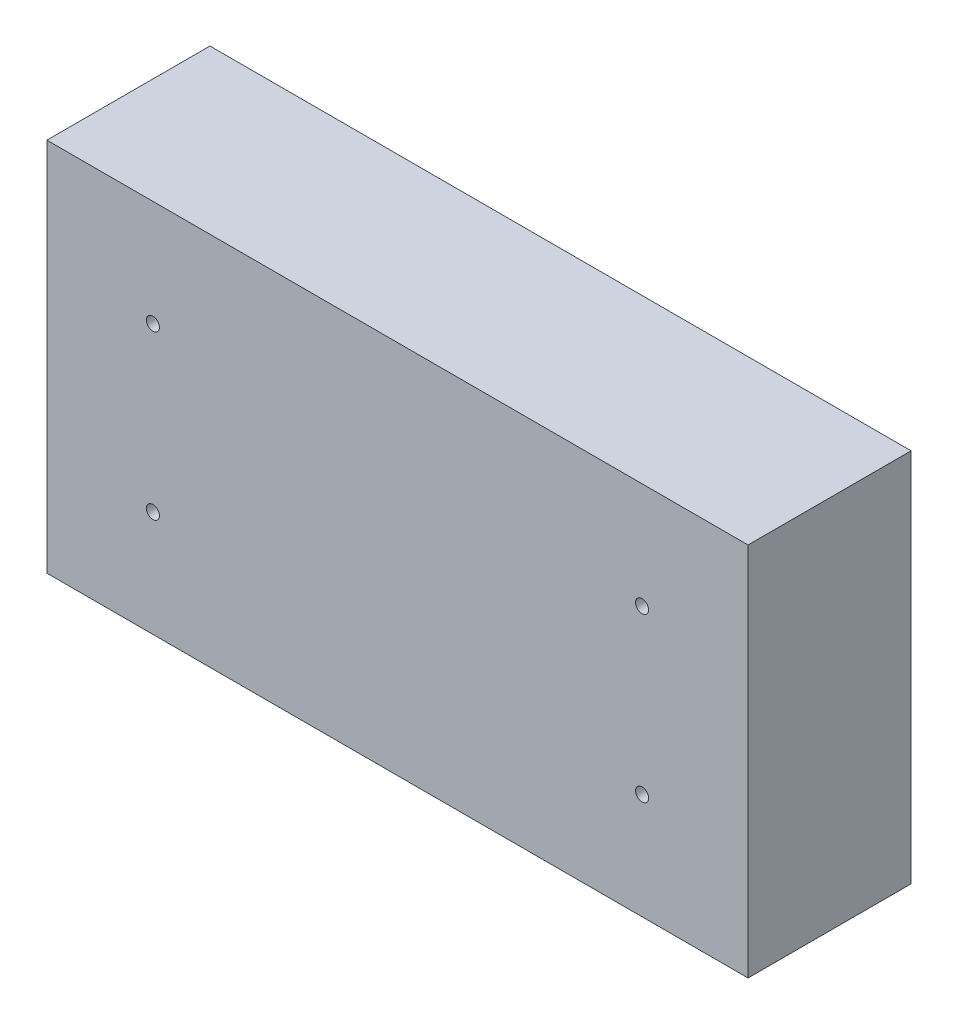
ISO-10303-21;
HEADER;
FILE_DESCRIPTION(('STEP AP214'),'2;1');
FILE_NAME('part.step','',(''),(''),'','','');
FILE_SCHEMA(('AUTOMOTIVE_DESIGN { 1 0 10303 214 1 1 1 1 }'));
ENDSEC;
DATA;
#1=APPLICATION_CONTEXT('core data for automotive mechanical design processes');
#2=APPLICATION_PROTOCOL_DEFINITION('international standard','automotive_design',2000,#1);
#3=PRODUCT_CONTEXT('',#1,'mechanical');
#4=PRODUCT('Part','Part','',(#3));
#5=PRODUCT_RELATED_PRODUCT_CATEGORY('part','',(#4));
#6=PRODUCT_DEFINITION_FORMATION('','',#4);
#7=PRODUCT_DEFINITION_CONTEXT('part definition',#1,'design');
#8=PRODUCT_DEFINITION('design','',#6,#7);
#9=PRODUCT_DEFINITION_SHAPE('','',#8);
#10=(LENGTH_UNIT() NAMED_UNIT(*) SI_UNIT(.MILLI.,.METRE.));
#11=(NAMED_UNIT(*) PLANE_ANGLE_UNIT() SI_UNIT($,.RADIAN.));
#12=(NAMED_UNIT(*) SI_UNIT($,.STERADIAN.) SOLID_ANGLE_UNIT());
#13=UNCERTAINTY_MEASURE_WITH_UNIT(LENGTH_MEASURE(1.E-05),#10,'distance_accuracy_value','');
#14=(GEOMETRIC_REPRESENTATION_CONTEXT(3) GLOBAL_UNCERTAINTY_ASSIGNED_CONTEXT((#13)) GLOBAL_UNIT_ASSIGNED_CONTEXT((#10,
#11,#12)) REPRESENTATION_CONTEXT('',''));
#15=CARTESIAN_POINT('',(0.,0.,0.));
#16=DIRECTION('',(0.,0.,1.));
#17=DIRECTION('',(1.,0.,0.));
#18=AXIS2_PLACEMENT_3D('',#15,#16,#17);
#19=CARTESIAN_POINT('',(182.5,32.5,44.3991393809724));
#20=DIRECTION('',(0.,0.,1.));
#21=DIRECTION('',(1.,0.,0.));
#22=AXIS2_PLACEMENT_3D('',#19,#20,#21);
#23=CONICAL_SURFACE('',#22,1.,1.02974425867665);
#24=CARTESIAN_POINT('',(182.5,32.5,43.7982787619449));
#25=VERTEX_POINT('',#24);
#26=VERTEX_LOOP('',#25);
#27=FACE_BOUND('',#26,.T.);
#28=CARTESIAN_POINT('',(182.5,32.5,45.));
#29=DIRECTION('',(0.,0.,1.));
#30=DIRECTION('',(1.,0.,0.));
#31=AXIS2_PLACEMENT_3D('',#28,#29,#30);
#32=CIRCLE('',#31,2.);
#33=CARTESIAN_POINT('',(184.5,32.5,45.));
#34=VERTEX_POINT('',#33);
#35=EDGE_CURVE('E9',#34,#34,#32,.T.);
#36=ORIENTED_EDGE('',*,*,#35,.T.);
#37=EDGE_LOOP('',(#36));
#38=FACE_BOUND('',#37,.T.);
#39=ADVANCED_FACE('F15',(#27,#38),#23,.F.);
#40=CARTESIAN_POINT('',(182.5,32.5,47.5));
#41=DIRECTION('',(0.,0.,1.));
#42=DIRECTION('',(1.,0.,0.));
#43=AXIS2_PLACEMENT_3D('',#40,#41,#42);
#44=CYLINDRICAL_SURFACE('',#43,2.);
#45=CARTESIAN_POINT('',(182.5,32.5,50.));
#46=DIRECTION('',(0.,0.,-1.));
#47=DIRECTION('',(0.,-1.,0.));
#48=AXIS2_PLACEMENT_3D('',#45,#46,#47);
#49=CIRCLE('',#48,2.);
#50=CARTESIAN_POINT('',(182.5,30.5,50.));
#51=VERTEX_POINT('',#50);
#52=EDGE_CURVE('E102',#51,#51,#49,.T.);
#53=ORIENTED_EDGE('',*,*,#52,.F.);
#54=EDGE_LOOP('',(#53));
#55=FACE_BOUND('',#54,.T.);
#56=ORIENTED_EDGE('',*,*,#35,.F.);
#57=EDGE_LOOP('',(#56));
#58=FACE_BOUND('',#57,.T.);
#59=ADVANCED_FACE('F131',(#55,#58),#44,.F.);
#60=CARTESIAN_POINT('',(32.5,82.5,44.3991393809724));
#61=DIRECTION('',(0.,0.,1.));
#62=DIRECTION('',(1.,0.,0.));
#63=AXIS2_PLACEMENT_3D('',#60,#61,#62);
#64=CONICAL_SURFACE('',#63,1.,1.02974425867665);
#65=CARTESIAN_POINT('',(32.5,82.5,43.7982787619449));
#66=VERTEX_POINT('',#65);
#67=VERTEX_LOOP('',#66);
#68=FACE_BOUND('',#67,.T.);
#69=CARTESIAN_POINT('',(32.5,82.5,45.));
#70=DIRECTION('',(0.,0.,1.));
#71=DIRECTION('',(1.,0.,0.));
#72=AXIS2_PLACEMENT_3D('',#69,#70,#71);
#73=CIRCLE('',#72,2.);
#74=CARTESIAN_POINT('',(34.5,82.5,45.));
#75=VERTEX_POINT('',#74);
#76=EDGE_CURVE('E24',#75,#75,#73,.T.);
#77=ORIENTED_EDGE('',*,*,#76,.T.);
#78=EDGE_LOOP('',(#77));
#79=FACE_BOUND('',#78,.T.);
#80=ADVANCED_FACE('F137',(#68,#79),#64,.F.);
#81=CARTESIAN_POINT('',(32.5,82.5,47.5));
#82=DIRECTION('',(0.,0.,1.));
#83=DIRECTION('',(1.,0.,0.));
#84=AXIS2_PLACEMENT_3D('',#81,#82,#83);
#85=CYLINDRICAL_SURFACE('',#84,2.);
#86=CARTESIAN_POINT('',(32.5,82.5,50.));
#87=DIRECTION('',(0.,0.,-1.));
#88=DIRECTION('',(0.,-1.,0.));
#89=AXIS2_PLACEMENT_3D('',#86,#87,#88);
#90=CIRCLE('',#89,2.);
#91=CARTESIAN_POINT('',(32.5,80.5,50.));
#92=VERTEX_POINT('',#91);
#93=EDGE_CURVE('E115',#92,#92,#90,.T.);
#94=ORIENTED_EDGE('',*,*,#93,.F.);
#95=EDGE_LOOP('',(#94));
#96=FACE_BOUND('',#95,.T.);
#97=ORIENTED_EDGE('',*,*,#76,.F.);
#98=EDGE_LOOP('',(#97));
#99=FACE_BOUND('',#98,.T.);
#100=ADVANCED_FACE('F144',(#96,#99),#85,.F.);
#101=CARTESIAN_POINT('',(32.5,32.5,44.3991393809724));
#102=DIRECTION('',(0.,0.,1.));
#103=DIRECTION('',(1.,0.,0.));
#104=AXIS2_PLACEMENT_3D('',#101,#102,#103);
#105=CONICAL_SURFACE('',#104,1.,1.02974425867665);
#106=CARTESIAN_POINT('',(32.5,32.5,43.7982787619449));
#107=VERTEX_POINT('',#106);
#108=VERTEX_LOOP('',#107);
#109=FACE_BOUND('',#108,.T.);
#110=CARTESIAN_POINT('',(32.5,32.5,45.));
#111=DIRECTION('',(0.,0.,1.));
#112=DIRECTION('',(1.,0.,0.));
#113=AXIS2_PLACEMENT_3D('',#110,#111,#112);
#114=CIRCLE('',#113,2.);
#115=CARTESIAN_POINT('',(34.5,32.5,45.));
#116=VERTEX_POINT('',#115);
#117=EDGE_CURVE('E218',#116,#116,#114,.T.);
#118=ORIENTED_EDGE('',*,*,#117,.T.);
#119=EDGE_LOOP('',(#118));
#120=FACE_BOUND('',#119,.T.);
#121=ADVANCED_FACE('F148',(#109,#120),#105,.F.);
#122=CARTESIAN_POINT('',(32.5,32.5,47.5));
#123=DIRECTION('',(0.,0.,1.));
#124=DIRECTION('',(1.,0.,0.));
#125=AXIS2_PLACEMENT_3D('',#122,#123,#124);
#126=CYLINDRICAL_SURFACE('',#125,2.);
#127=CARTESIAN_POINT('',(32.5,32.5,50.));
#128=DIRECTION('',(0.,0.,-1.));
#129=DIRECTION('',(0.,-1.,0.));
#130=AXIS2_PLACEMENT_3D('',#127,#128,#129);
#131=CIRCLE('',#130,2.);
#132=CARTESIAN_POINT('',(32.5,30.5,50.));
#133=VERTEX_POINT('',#132);
#134=EDGE_CURVE('E110',#133,#133,#131,.T.);
#135=ORIENTED_EDGE('',*,*,#134,.F.);
#136=EDGE_LOOP('',(#135));
#137=FACE_BOUND('',#136,.T.);
#138=ORIENTED_EDGE('',*,*,#117,.F.);
#139=EDGE_LOOP('',(#138));
#140=FACE_BOUND('',#139,.T.);
#141=ADVANCED_FACE('F152',(#137,#140),#126,.F.);
#142=CARTESIAN_POINT('',(182.5,82.5,44.3991393809724));
#143=DIRECTION('',(0.,0.,1.));
#144=DIRECTION('',(1.,0.,0.));
#145=AXIS2_PLACEMENT_3D('',#142,#143,#144);
#146=CONICAL_SURFACE('',#145,1.,1.02974425867665);
#147=CARTESIAN_POINT('',(182.5,82.5,43.7982787619449));
#148=VERTEX_POINT('',#147);
#149=VERTEX_LOOP('',#148);
#150=FACE_BOUND('',#149,.T.);
#151=CARTESIAN_POINT('',(182.5,82.5,45.));
#152=DIRECTION('',(0.,0.,1.));
#153=DIRECTION('',(1.,0.,0.));
#154=AXIS2_PLACEMENT_3D('',#151,#152,#153);
#155=CIRCLE('',#154,2.);
#156=CARTESIAN_POINT('',(184.5,82.5,45.));
#157=VERTEX_POINT('',#156);
#158=EDGE_CURVE('E83',#157,#157,#155,.T.);
#159=ORIENTED_EDGE('',*,*,#158,.T.);
#160=EDGE_LOOP('',(#159));
#161=FACE_BOUND('',#160,.T.);
#162=ADVANCED_FACE('F155',(#150,#161),#146,.F.);
#163=CARTESIAN_POINT('',(182.5,82.5,47.5));
#164=DIRECTION('',(0.,0.,1.));
#165=DIRECTION('',(1.,0.,0.));
#166=AXIS2_PLACEMENT_3D('',#163,#164,#165);
#167=CYLINDRICAL_SURFACE('',#166,2.);
#168=CARTESIAN_POINT('',(182.5,82.5,50.));
#169=DIRECTION('',(0.,0.,-1.));
#170=DIRECTION('',(0.,-1.,0.));
#171=AXIS2_PLACEMENT_3D('',#168,#169,#170);
#172=CIRCLE('',#171,2.);
#173=CARTESIAN_POINT('',(182.5,80.5,50.));
#174=VERTEX_POINT('',#173);
#175=EDGE_CURVE('E108',#174,#174,#172,.T.);
#176=ORIENTED_EDGE('',*,*,#175,.F.);
#177=EDGE_LOOP('',(#176));
#178=FACE_BOUND('',#177,.T.);
#179=ORIENTED_EDGE('',*,*,#158,.F.);
#180=EDGE_LOOP('',(#179));
#181=FACE_BOUND('',#180,.T.);
#182=ADVANCED_FACE('F159',(#178,#181),#167,.F.);
#183=CARTESIAN_POINT('',(0.,115.,0.));
#184=DIRECTION('',(-1.,0.,0.));
#185=DIRECTION('',(0.,-1.,0.));
#186=AXIS2_PLACEMENT_3D('',#183,#184,#185);
#187=PLANE('',#186);
#188=DIRECTION('',(0.,-1.,0.));
#189=VECTOR('',#188,1.);
#190=CARTESIAN_POINT('',(0.,115.,0.));
#191=LINE('',#190,#189);
#192=CARTESIAN_POINT('',(0.,115.,0.));
#193=VERTEX_POINT('',#192);
#194=CARTESIAN_POINT('',(0.,0.,0.));
#195=VERTEX_POINT('',#194);
#196=EDGE_CURVE('E68',#193,#195,#191,.T.);
#197=ORIENTED_EDGE('',*,*,#196,.T.);
#198=DIRECTION('',(0.,0.,1.));
#199=VECTOR('',#198,1.);
#200=CARTESIAN_POINT('',(0.,0.,0.));
#201=LINE('',#200,#199);
#202=CARTESIAN_POINT('',(0.,0.,50.));
#203=VERTEX_POINT('',#202);
#204=EDGE_CURVE('E84',#195,#203,#201,.T.);
#205=ORIENTED_EDGE('',*,*,#204,.T.);
#206=DIRECTION('',(0.,-1.,0.));
#207=VECTOR('',#206,1.);
#208=CARTESIAN_POINT('',(0.,115.,50.));
#209=LINE('',#208,#207);
#210=CARTESIAN_POINT('',(0.,115.,50.));
#211=VERTEX_POINT('',#210);
#212=EDGE_CURVE('E70',#211,#203,#209,.T.);
#213=ORIENTED_EDGE('',*,*,#212,.F.);
#214=DIRECTION('',(0.,0.,1.));
#215=VECTOR('',#214,1.);
#216=CARTESIAN_POINT('',(0.,115.,0.));
#217=LINE('',#216,#215);
#218=EDGE_CURVE('E64',#193,#211,#217,.T.);
#219=ORIENTED_EDGE('',*,*,#218,.F.);
#220=EDGE_LOOP('',(#197,#205,#213,#219));
#221=FACE_BOUND('',#220,.T.);
#222=ADVANCED_FACE('F66',(#221),#187,.T.);
#223=CARTESIAN_POINT('',(215.,115.,0.));
#224=DIRECTION('',(0.,1.,0.));
#225=DIRECTION('',(-1.,0.,0.));
#226=AXIS2_PLACEMENT_3D('',#223,#224,#225);
#227=PLANE('',#226);
#228=DIRECTION('',(-1.,0.,0.));
#229=VECTOR('',#228,1.);
#230=CARTESIAN_POINT('',(215.,115.,0.));
#231=LINE('',#230,#229);
#232=CARTESIAN_POINT('',(215.,115.,0.));
#233=VERTEX_POINT('',#232);
#234=EDGE_CURVE('E74',#233,#193,#231,.T.);
#235=ORIENTED_EDGE('',*,*,#234,.T.);
#236=ORIENTED_EDGE('',*,*,#218,.T.);
#237=DIRECTION('',(-1.,0.,0.));
#238=VECTOR('',#237,1.);
#239=CARTESIAN_POINT('',(215.,115.,50.));
#240=LINE('',#239,#238);
#241=CARTESIAN_POINT('',(215.,115.,50.));
#242=VERTEX_POINT('',#241);
#243=EDGE_CURVE('E93',#242,#211,#240,.T.);
#244=ORIENTED_EDGE('',*,*,#243,.F.);
#245=DIRECTION('',(0.,0.,1.));
#246=VECTOR('',#245,1.);
#247=CARTESIAN_POINT('',(215.,115.,0.));
#248=LINE('',#247,#246);
#249=EDGE_CURVE('E88',#233,#242,#248,.T.);
#250=ORIENTED_EDGE('',*,*,#249,.F.);
#251=EDGE_LOOP('',(#235,#236,#244,#250));
#252=FACE_BOUND('',#251,.T.);
#253=ADVANCED_FACE('F86',(#252),#227,.T.);
#254=CARTESIAN_POINT('',(215.,0.,0.));
#255=DIRECTION('',(1.,0.,0.));
#256=DIRECTION('',(0.,1.,0.));
#257=AXIS2_PLACEMENT_3D('',#254,#255,#256);
#258=PLANE('',#257);
#259=DIRECTION('',(0.,1.,0.));
#260=VECTOR('',#259,1.);
#261=CARTESIAN_POINT('',(215.,0.,0.));
#262=LINE('',#261,#260);
#263=CARTESIAN_POINT('',(215.,0.,0.));
#264=VERTEX_POINT('',#263);
#265=EDGE_CURVE('E75',#264,#233,#262,.T.);
#266=ORIENTED_EDGE('',*,*,#265,.T.);
#267=ORIENTED_EDGE('',*,*,#249,.T.);
#268=DIRECTION('',(0.,1.,0.));
#269=VECTOR('',#268,1.);
#270=CARTESIAN_POINT('',(215.,0.,50.));
#271=LINE('',#270,#269);
#272=CARTESIAN_POINT('',(215.,0.,50.));
#273=VERTEX_POINT('',#272);
#274=EDGE_CURVE('E95',#273,#242,#271,.T.);
#275=ORIENTED_EDGE('',*,*,#274,.F.);
#276=DIRECTION('',(0.,0.,1.));
#277=VECTOR('',#276,1.);
#278=CARTESIAN_POINT('',(215.,0.,0.));
#279=LINE('',#278,#277);
#280=EDGE_CURVE('E100',#264,#273,#279,.T.);
#281=ORIENTED_EDGE('',*,*,#280,.F.);
#282=EDGE_LOOP('',(#266,#267,#275,#281));
#283=FACE_BOUND('',#282,.T.);
#284=ADVANCED_FACE('F120',(#283),#258,.T.);
#285=CARTESIAN_POINT('',(0.,0.,0.));
#286=DIRECTION('',(0.,-1.,0.));
#287=DIRECTION('',(0.,0.,-1.));
#288=AXIS2_PLACEMENT_3D('',#285,#286,#287);
#289=PLANE('',#288);
#290=DIRECTION('',(1.,0.,0.));
#291=VECTOR('',#290,1.);
#292=CARTESIAN_POINT('',(0.,0.,0.));
#293=LINE('',#292,#291);
#294=EDGE_CURVE('E82',#195,#264,#293,.T.);
#295=ORIENTED_EDGE('',*,*,#294,.T.);
#296=ORIENTED_EDGE('',*,*,#280,.T.);
#297=DIRECTION('',(1.,0.,0.));
#298=VECTOR('',#297,1.);
#299=CARTESIAN_POINT('',(0.,0.,50.));
#300=LINE('',#299,#298);
#301=EDGE_CURVE('E19',#203,#273,#300,.T.);
#302=ORIENTED_EDGE('',*,*,#301,.F.);
#303=ORIENTED_EDGE('',*,*,#204,.F.);
#304=EDGE_LOOP('',(#295,#296,#302,#303));
#305=FACE_BOUND('',#304,.T.);
#306=ADVANCED_FACE('F104',(#305),#289,.T.);
#307=CARTESIAN_POINT('',(107.5,57.5,50.));
#308=DIRECTION('',(0.,0.,1.));
#309=DIRECTION('',(1.,0.,0.));
#310=AXIS2_PLACEMENT_3D('',#307,#308,#309);
#311=PLANE('',#310);
#312=ORIENTED_EDGE('',*,*,#52,.T.);
#313=EDGE_LOOP('',(#312));
#314=FACE_BOUND('',#313,.T.);
#315=ORIENTED_EDGE('',*,*,#93,.T.);
#316=EDGE_LOOP('',(#315));
#317=FACE_BOUND('',#316,.T.);
#318=ORIENTED_EDGE('',*,*,#134,.T.);
#319=EDGE_LOOP('',(#318));
#320=FACE_BOUND('',#319,.T.);
#321=ORIENTED_EDGE('',*,*,#175,.T.);
#322=EDGE_LOOP('',(#321));
#323=FACE_BOUND('',#322,.T.);
#324=ORIENTED_EDGE('',*,*,#301,.T.);
#325=ORIENTED_EDGE('',*,*,#274,.T.);
#326=ORIENTED_EDGE('',*,*,#243,.T.);
#327=ORIENTED_EDGE('',*,*,#212,.T.);
#328=EDGE_LOOP('',(#324,#325,#326,#327));
#329=FACE_BOUND('',#328,.T.);
#330=ADVANCED_FACE('F118',(#314,#317,#320,#323,#329),#311,.T.);
#331=CARTESIAN_POINT('',(107.5,57.5,0.));
#332=DIRECTION('',(0.,0.,1.));
#333=DIRECTION('',(1.,0.,0.));
#334=AXIS2_PLACEMENT_3D('',#331,#332,#333);
#335=PLANE('',#334);
#336=ORIENTED_EDGE('',*,*,#294,.F.);
#337=ORIENTED_EDGE('',*,*,#196,.F.);
#338=ORIENTED_EDGE('',*,*,#234,.F.);
#339=ORIENTED_EDGE('',*,*,#265,.F.);
#340=EDGE_LOOP('',(#336,#337,#338,#339));
#341=FACE_BOUND('',#340,.T.);
#342=ADVANCED_FACE('F17',(#341),#335,.F.);
#343=CLOSED_SHELL('',(#39,#59,#80,#100,#121,#141,#162,#182,#222,#253,#284,#306,#330,#342));
#344=MANIFOLD_SOLID_BREP('B1',#343);
#345=ADVANCED_BREP_SHAPE_REPRESENTATION('',(#18,#344),#14);
#346=SHAPE_DEFINITION_REPRESENTATION(#9,#345);
ENDSEC;
END-ISO-10303-21;
